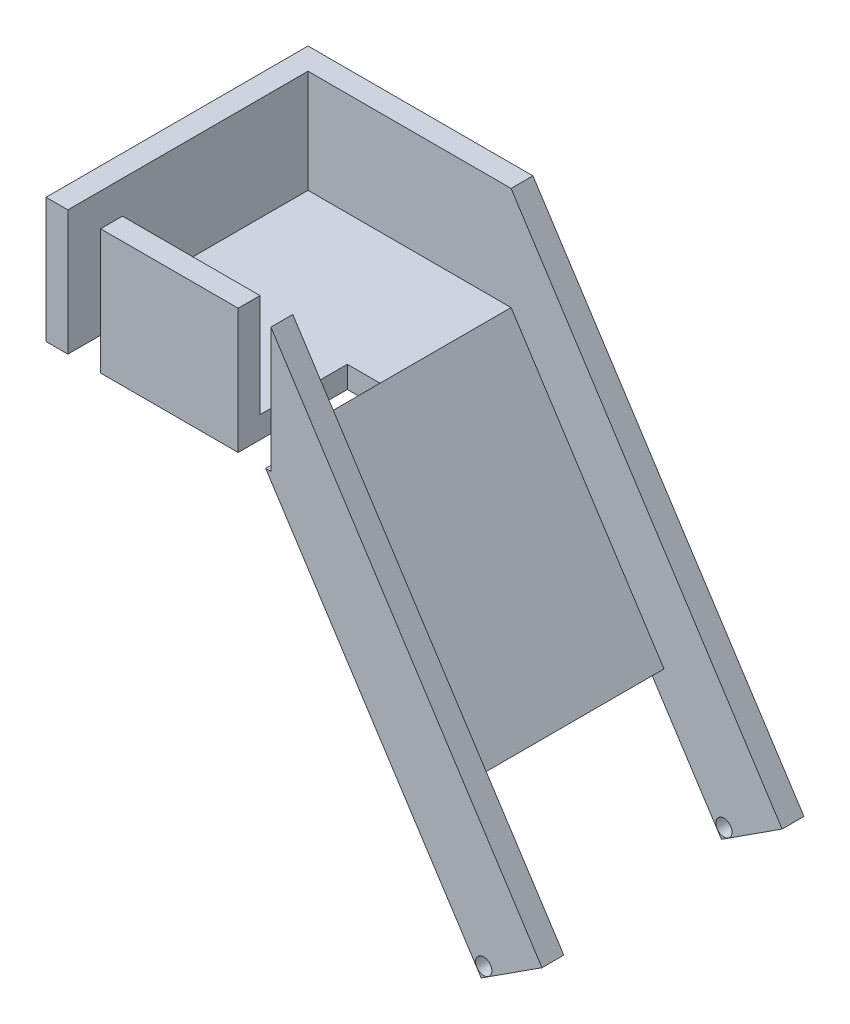
ISO-10303-21;
HEADER;
FILE_DESCRIPTION(('STEP AP214'),'2;1');
FILE_NAME('part.step','',(''),(''),'','','');
FILE_SCHEMA(('AUTOMOTIVE_DESIGN { 1 0 10303 214 1 1 1 1 }'));
ENDSEC;
DATA;
#1=APPLICATION_CONTEXT('core data for automotive mechanical design processes');
#2=APPLICATION_PROTOCOL_DEFINITION('international standard','automotive_design',2000,#1);
#3=PRODUCT_CONTEXT('',#1,'mechanical');
#4=PRODUCT('Part','Part','',(#3));
#5=PRODUCT_RELATED_PRODUCT_CATEGORY('part','',(#4));
#6=PRODUCT_DEFINITION_FORMATION('','',#4);
#7=PRODUCT_DEFINITION_CONTEXT('part definition',#1,'design');
#8=PRODUCT_DEFINITION('design','',#6,#7);
#9=PRODUCT_DEFINITION_SHAPE('','',#8);
#10=(LENGTH_UNIT() NAMED_UNIT(*) SI_UNIT(.MILLI.,.METRE.));
#11=(NAMED_UNIT(*) PLANE_ANGLE_UNIT() SI_UNIT($,.RADIAN.));
#12=(NAMED_UNIT(*) SI_UNIT($,.STERADIAN.) SOLID_ANGLE_UNIT());
#13=UNCERTAINTY_MEASURE_WITH_UNIT(LENGTH_MEASURE(1.E-05),#10,'distance_accuracy_value','');
#14=(GEOMETRIC_REPRESENTATION_CONTEXT(3) GLOBAL_UNCERTAINTY_ASSIGNED_CONTEXT((#13)) GLOBAL_UNIT_ASSIGNED_CONTEXT((#10,
#11,#12)) REPRESENTATION_CONTEXT('',''));
#15=CARTESIAN_POINT('',(0.,0.,0.));
#16=DIRECTION('',(0.,0.,1.));
#17=DIRECTION('',(1.,0.,0.));
#18=AXIS2_PLACEMENT_3D('',#15,#16,#17);
#19=CARTESIAN_POINT('',(69.0793002450423,-59.004889790228,-120.));
#20=DIRECTION('',(0.542913236200451,-0.839788793660855,0.));
#21=DIRECTION('',(0.839788793660855,0.542913236200451,0.));
#22=AXIS2_PLACEMENT_3D('',#19,#20,#21);
#23=PLANE('',#22);
#24=DIRECTION('',(0.,0.,1.));
#25=VECTOR('',#24,1.);
#26=CARTESIAN_POINT('',(62.8173272538295,-63.0531791307406,-120.));
#27=LINE('',#26,#25);
#28=CARTESIAN_POINT('',(62.8173272538295,-63.0531791307406,-10.));
#29=VERTEX_POINT('',#28);
#30=CARTESIAN_POINT('',(62.8173272538295,-63.0531791307406,0.));
#31=VERTEX_POINT('',#30);
#32=EDGE_CURVE('E238',#29,#31,#27,.T.);
#33=ORIENTED_EDGE('',*,*,#32,.F.);
#34=DIRECTION('',(0.839788793660855,0.54291323620045,0.));
#35=VECTOR('',#34,1.);
#36=CARTESIAN_POINT('',(90.6221085874557,-45.0777263387602,-10.));
#37=LINE('',#36,#35);
#38=CARTESIAN_POINT('',(90.6221085874557,-45.0777263387602,-10.));
#39=VERTEX_POINT('',#38);
#40=EDGE_CURVE('E297',#29,#39,#37,.T.);
#41=ORIENTED_EDGE('',*,*,#40,.T.);
#42=DIRECTION('',(0.,0.,1.));
#43=VECTOR('',#42,1.);
#44=CARTESIAN_POINT('',(90.6221085874557,-45.0777263387602,-10.));
#45=LINE('',#44,#43);
#46=CARTESIAN_POINT('',(90.6221085874557,-45.0777263387602,0.));
#47=VERTEX_POINT('',#46);
#48=EDGE_CURVE('E296',#39,#47,#45,.T.);
#49=ORIENTED_EDGE('',*,*,#48,.T.);
#50=DIRECTION('',(0.839788793660855,0.542913236200451,0.));
#51=VECTOR('',#50,1.);
#52=CARTESIAN_POINT('',(69.0793002450423,-59.004889790228,0.));
#53=LINE('',#52,#51);
#54=EDGE_CURVE('E248',#31,#47,#53,.T.);
#55=ORIENTED_EDGE('',*,*,#54,.F.);
#56=EDGE_LOOP('',(#33,#41,#49,#55));
#57=FACE_BOUND('',#56,.T.);
#58=ADVANCED_FACE('F33',(#57),#23,.T.);
#59=CARTESIAN_POINT('',(0.,0.,0.));
#60=DIRECTION('',(0.,0.,1.));
#61=DIRECTION('',(1.,0.,0.));
#62=AXIS2_PLACEMENT_3D('',#59,#60,#61);
#63=PLANE('',#62);
#64=DIRECTION('',(0.,-1.,0.));
#65=VECTOR('',#64,1.);
#66=CARTESIAN_POINT('',(-48.5313013968429,146.965192211674,0.));
#67=LINE('',#66,#65);
#68=CARTESIAN_POINT('',(-48.5313013968429,146.965192211674,0.));
#69=VERTEX_POINT('',#68);
#70=CARTESIAN_POINT('',(-48.5313013968429,89.7151922116735,0.));
#71=VERTEX_POINT('',#70);
#72=EDGE_CURVE('E452',#69,#71,#67,.T.);
#73=ORIENTED_EDGE('',*,*,#72,.F.);
#74=DIRECTION('',(1.,0.,0.));
#75=VECTOR('',#74,1.);
#76=CARTESIAN_POINT('',(-136.531301396843,146.965192211674,0.));
#77=LINE('',#76,#75);
#78=CARTESIAN_POINT('',(-111.531301396843,146.965192211674,0.));
#79=VERTEX_POINT('',#78);
#80=EDGE_CURVE('E321',#79,#69,#77,.T.);
#81=ORIENTED_EDGE('',*,*,#80,.F.);
#82=DIRECTION('',(0.,1.,0.));
#83=VECTOR('',#82,1.);
#84=CARTESIAN_POINT('',(-111.531301396843,146.965192211674,0.));
#85=LINE('',#84,#83);
#86=CARTESIAN_POINT('',(-111.531301396843,89.7151922116735,0.));
#87=VERTEX_POINT('',#86);
#88=EDGE_CURVE('E56',#87,#79,#85,.T.);
#89=ORIENTED_EDGE('',*,*,#88,.F.);
#90=DIRECTION('',(1.,0.,0.));
#91=VECTOR('',#90,1.);
#92=CARTESIAN_POINT('',(-136.531301396843,89.7151922116735,0.));
#93=LINE('',#92,#91);
#94=EDGE_CURVE('E272',#87,#71,#93,.T.);
#95=ORIENTED_EDGE('',*,*,#94,.T.);
#96=EDGE_LOOP('',(#73,#81,#89,#95));
#97=FACE_BOUND('',#96,.T.);
#98=ADVANCED_FACE('F368',(#97),#63,.T.);
#99=CARTESIAN_POINT('',(-33.5313013968429,146.965192211674,-10.));
#100=DIRECTION('',(0.,0.,1.));
#101=DIRECTION('',(1.,0.,0.));
#102=AXIS2_PLACEMENT_3D('',#99,#100,#101);
#103=PLANE('',#102);
#104=DIRECTION('',(-1.,0.,0.));
#105=VECTOR('',#104,1.);
#106=CARTESIAN_POINT('',(-33.5313013968429,146.965192211674,-10.));
#107=LINE('',#106,#105);
#108=CARTESIAN_POINT('',(-48.5313013968429,146.965192211674,-10.));
#109=VERTEX_POINT('',#108);
#110=CARTESIAN_POINT('',(-111.531301396843,146.965192211674,-10.));
#111=VERTEX_POINT('',#110);
#112=EDGE_CURVE('E326',#109,#111,#107,.T.);
#113=ORIENTED_EDGE('',*,*,#112,.F.);
#114=DIRECTION('',(0.,-1.,0.));
#115=VECTOR('',#114,1.);
#116=CARTESIAN_POINT('',(-48.5313013968429,146.965192211674,-10.));
#117=LINE('',#116,#115);
#118=CARTESIAN_POINT('',(-48.5313013968429,99.7151922116736,-10.));
#119=VERTEX_POINT('',#118);
#120=EDGE_CURVE('E397',#109,#119,#117,.T.);
#121=ORIENTED_EDGE('',*,*,#120,.T.);
#122=DIRECTION('',(-1.,0.,0.));
#123=VECTOR('',#122,1.);
#124=CARTESIAN_POINT('',(-33.5313013968429,99.7151922116736,-10.));
#125=LINE('',#124,#123);
#126=CARTESIAN_POINT('',(-111.531301396843,99.7151922116736,-10.));
#127=VERTEX_POINT('',#126);
#128=EDGE_CURVE('E224',#119,#127,#125,.T.);
#129=ORIENTED_EDGE('',*,*,#128,.T.);
#130=DIRECTION('',(0.,1.,0.));
#131=VECTOR('',#130,1.);
#132=CARTESIAN_POINT('',(-111.531301396843,146.965192211673,-10.));
#133=LINE('',#132,#131);
#134=EDGE_CURVE('E416',#127,#111,#133,.T.);
#135=ORIENTED_EDGE('',*,*,#134,.T.);
#136=EDGE_LOOP('',(#113,#121,#129,#135));
#137=FACE_BOUND('',#136,.T.);
#138=ADVANCED_FACE('F374',(#137),#103,.F.);
#139=DIRECTION('',(0.,-1.,0.));
#140=VECTOR('',#139,1.);
#141=CARTESIAN_POINT('',(-126.531301396843,89.7151922116735,0.));
#142=LINE('',#141,#140);
#143=CARTESIAN_POINT('',(-126.531301396843,146.965192211674,0.));
#144=VERTEX_POINT('',#143);
#145=CARTESIAN_POINT('',(-126.531301396843,89.7151922116735,0.));
#146=VERTEX_POINT('',#145);
#147=EDGE_CURVE('E395',#144,#146,#142,.T.);
#148=ORIENTED_EDGE('',*,*,#147,.F.);
#149=CARTESIAN_POINT('',(-136.531301396843,146.965192211674,0.));
#150=VERTEX_POINT('',#149);
#151=EDGE_CURVE('E322',#150,#144,#77,.T.);
#152=ORIENTED_EDGE('',*,*,#151,.F.);
#153=DIRECTION('',(0.,-1.,0.));
#154=VECTOR('',#153,1.);
#155=CARTESIAN_POINT('',(-136.531301396843,99.7151922116736,0.));
#156=LINE('',#155,#154);
#157=CARTESIAN_POINT('',(-136.531301396843,89.7151922116735,0.));
#158=VERTEX_POINT('',#157);
#159=EDGE_CURVE('E269',#150,#158,#156,.T.);
#160=ORIENTED_EDGE('',*,*,#159,.T.);
#161=EDGE_CURVE('E274',#158,#146,#93,.T.);
#162=ORIENTED_EDGE('',*,*,#161,.T.);
#163=EDGE_LOOP('',(#148,#152,#160,#162));
#164=FACE_BOUND('',#163,.T.);
#165=ADVANCED_FACE('F356',(#164),#63,.T.);
#166=CARTESIAN_POINT('',(0.,146.965192211674,0.));
#167=DIRECTION('',(0.,1.,0.));
#168=DIRECTION('',(0.,0.,1.));
#169=AXIS2_PLACEMENT_3D('',#166,#167,#168);
#170=PLANE('',#169);
#171=ORIENTED_EDGE('',*,*,#151,.T.);
#172=DIRECTION('',(0.,0.,-1.));
#173=VECTOR('',#172,1.);
#174=CARTESIAN_POINT('',(-126.531301396843,146.965192211674,-9.99999999999999));
#175=LINE('',#174,#173);
#176=CARTESIAN_POINT('',(-126.531301396843,146.965192211674,-110.));
#177=VERTEX_POINT('',#176);
#178=EDGE_CURVE('E289',#144,#177,#175,.T.);
#179=ORIENTED_EDGE('',*,*,#178,.T.);
#180=DIRECTION('',(1.,0.,0.));
#181=VECTOR('',#180,1.);
#182=CARTESIAN_POINT('',(-126.531301396843,146.965192211674,-110.));
#183=LINE('',#182,#181);
#184=CARTESIAN_POINT('',(-33.5313013968429,146.965192211674,-110.));
#185=VERTEX_POINT('',#184);
#186=EDGE_CURVE('E292',#177,#185,#183,.T.);
#187=ORIENTED_EDGE('',*,*,#186,.T.);
#188=DIRECTION('',(0.,0.,-1.));
#189=VECTOR('',#188,1.);
#190=CARTESIAN_POINT('',(-33.5313013968429,146.965192211674,-110.));
#191=LINE('',#190,#189);
#192=CARTESIAN_POINT('',(-33.5313013968429,146.965192211674,-120.));
#193=VERTEX_POINT('',#192);
#194=EDGE_CURVE('E312',#185,#193,#191,.T.);
#195=ORIENTED_EDGE('',*,*,#194,.T.);
#196=DIRECTION('',(-1.,0.,0.));
#197=VECTOR('',#196,1.);
#198=CARTESIAN_POINT('',(-33.5313013968429,146.965192211674,-120.));
#199=LINE('',#198,#197);
#200=CARTESIAN_POINT('',(-136.531301396843,146.965192211674,-120.));
#201=VERTEX_POINT('',#200);
#202=EDGE_CURVE('E315',#193,#201,#199,.T.);
#203=ORIENTED_EDGE('',*,*,#202,.T.);
#204=DIRECTION('',(0.,0.,1.));
#205=VECTOR('',#204,1.);
#206=CARTESIAN_POINT('',(-136.531301396843,146.965192211674,-120.));
#207=LINE('',#206,#205);
#208=EDGE_CURVE('E318',#201,#150,#207,.T.);
#209=ORIENTED_EDGE('',*,*,#208,.T.);
#210=EDGE_LOOP('',(#171,#179,#187,#195,#203,#209));
#211=FACE_BOUND('',#210,.T.);
#212=ADVANCED_FACE('F332',(#211),#170,.T.);
#213=CARTESIAN_POINT('',(-33.5313013968429,99.7151922116736,-120.));
#214=DIRECTION('',(0.839788793660855,0.542913236200451,0.));
#215=DIRECTION('',(-0.542913236200451,0.839788793660855,0.));
#216=AXIS2_PLACEMENT_3D('',#213,#214,#215);
#217=PLANE('',#216);
#218=DIRECTION('',(0.,0.,1.));
#219=VECTOR('',#218,1.);
#220=CARTESIAN_POINT('',(36.5045060730152,-8.6175621705767,-10.));
#221=LINE('',#220,#219);
#222=CARTESIAN_POINT('',(36.5045060730152,-8.6175621705767,-110.));
#223=VERTEX_POINT('',#222);
#224=CARTESIAN_POINT('',(36.5045060730152,-8.61756217057669,-10.));
#225=VERTEX_POINT('',#224);
#226=EDGE_CURVE('E48',#223,#225,#221,.T.);
#227=ORIENTED_EDGE('',*,*,#226,.F.);
#228=DIRECTION('',(-0.542913236200451,0.839788793660855,0.));
#229=VECTOR('',#228,1.);
#230=CARTESIAN_POINT('',(69.0793002450423,-59.004889790228,-110.));
#231=LINE('',#230,#229);
#232=CARTESIAN_POINT('',(-33.5313013968429,99.7151922116736,-110.));
#233=VERTEX_POINT('',#232);
#234=EDGE_CURVE('E201',#223,#233,#231,.T.);
#235=ORIENTED_EDGE('',*,*,#234,.T.);
#236=DIRECTION('',(0.,0.,1.));
#237=VECTOR('',#236,1.);
#238=CARTESIAN_POINT('',(-33.5313013968429,99.7151922116736,-120.));
#239=LINE('',#238,#237);
#240=CARTESIAN_POINT('',(-33.5313013968429,99.7151922116736,-50.));
#241=VERTEX_POINT('',#240);
#242=EDGE_CURVE('E232',#233,#241,#239,.T.);
#243=ORIENTED_EDGE('',*,*,#242,.T.);
#244=DIRECTION('',(0.,0.,-1.));
#245=VECTOR('',#244,1.);
#246=CARTESIAN_POINT('',(-33.5313013968429,99.7151922116736,-120.));
#247=LINE('',#246,#245);
#248=CARTESIAN_POINT('',(-33.5313013968429,99.7151922116736,-10.));
#249=VERTEX_POINT('',#248);
#250=EDGE_CURVE('E460',#249,#241,#247,.T.);
#251=ORIENTED_EDGE('',*,*,#250,.F.);
#252=DIRECTION('',(0.542913236200451,-0.839788793660855,0.));
#253=VECTOR('',#252,1.);
#254=CARTESIAN_POINT('',(69.0793002450423,-59.004889790228,-10.));
#255=LINE('',#254,#253);
#256=EDGE_CURVE('E205',#249,#225,#255,.T.);
#257=ORIENTED_EDGE('',*,*,#256,.T.);
#258=EDGE_LOOP('',(#227,#235,#243,#251,#257));
#259=FACE_BOUND('',#258,.T.);
#260=ADVANCED_FACE('F199',(#259),#217,.T.);
#261=CARTESIAN_POINT('',(-136.531301396843,99.7151922116736,-120.));
#262=DIRECTION('',(-1.,0.,0.));
#263=DIRECTION('',(0.,0.,1.));
#264=AXIS2_PLACEMENT_3D('',#261,#262,#263);
#265=PLANE('',#264);
#266=ORIENTED_EDGE('',*,*,#159,.F.);
#267=ORIENTED_EDGE('',*,*,#208,.F.);
#268=DIRECTION('',(0.,-1.,0.));
#269=VECTOR('',#268,1.);
#270=CARTESIAN_POINT('',(-136.531301396843,99.7151922116736,-120.));
#271=LINE('',#270,#269);
#272=CARTESIAN_POINT('',(-136.531301396843,89.7151922116735,-120.));
#273=VERTEX_POINT('',#272);
#274=EDGE_CURVE('E281',#201,#273,#271,.T.);
#275=ORIENTED_EDGE('',*,*,#274,.T.);
#276=DIRECTION('',(0.,0.,1.));
#277=VECTOR('',#276,1.);
#278=CARTESIAN_POINT('',(-136.531301396843,89.7151922116735,-120.));
#279=LINE('',#278,#277);
#280=EDGE_CURVE('E242',#273,#158,#279,.T.);
#281=ORIENTED_EDGE('',*,*,#280,.T.);
#282=EDGE_LOOP('',(#266,#267,#275,#281));
#283=FACE_BOUND('',#282,.T.);
#284=ADVANCED_FACE('F35',(#283),#265,.T.);
#285=CARTESIAN_POINT('',(-136.531301396843,99.7151922116736,-120.));
#286=DIRECTION('',(0.,1.,0.));
#287=DIRECTION('',(0.,0.,1.));
#288=AXIS2_PLACEMENT_3D('',#285,#286,#287);
#289=PLANE('',#288);
#290=DIRECTION('',(0.,0.,1.));
#291=VECTOR('',#290,1.);
#292=CARTESIAN_POINT('',(-48.5313013968429,99.7151922116736,-120.));
#293=LINE('',#292,#291);
#294=CARTESIAN_POINT('',(-48.5313013968429,99.7151922116736,-50.));
#295=VERTEX_POINT('',#294);
#296=EDGE_CURVE('E392',#295,#119,#293,.T.);
#297=ORIENTED_EDGE('',*,*,#296,.F.);
#298=DIRECTION('',(1.,0.,0.));
#299=VECTOR('',#298,1.);
#300=CARTESIAN_POINT('',(-136.531301396843,99.7151922116736,-50.));
#301=LINE('',#300,#299);
#302=EDGE_CURVE('E391',#295,#241,#301,.T.);
#303=ORIENTED_EDGE('',*,*,#302,.T.);
#304=ORIENTED_EDGE('',*,*,#242,.F.);
#305=DIRECTION('',(1.,0.,0.));
#306=VECTOR('',#305,1.);
#307=CARTESIAN_POINT('',(-126.531301396843,99.7151922116736,-110.));
#308=LINE('',#307,#306);
#309=CARTESIAN_POINT('',(-126.531301396843,99.7151922116736,-110.));
#310=VERTEX_POINT('',#309);
#311=EDGE_CURVE('E212',#310,#233,#308,.T.);
#312=ORIENTED_EDGE('',*,*,#311,.F.);
#313=DIRECTION('',(0.,0.,-1.));
#314=VECTOR('',#313,1.);
#315=CARTESIAN_POINT('',(-126.531301396843,99.7151922116736,-9.99999999999999));
#316=LINE('',#315,#314);
#317=CARTESIAN_POINT('',(-126.531301396843,99.7151922116736,-50.));
#318=VERTEX_POINT('',#317);
#319=EDGE_CURVE('E290',#318,#310,#316,.T.);
#320=ORIENTED_EDGE('',*,*,#319,.F.);
#321=DIRECTION('',(-1.,0.,0.));
#322=VECTOR('',#321,1.);
#323=CARTESIAN_POINT('',(-136.531301396843,99.7151922116736,-50.));
#324=LINE('',#323,#322);
#325=CARTESIAN_POINT('',(-111.531301396843,99.7151922116736,-50.));
#326=VERTEX_POINT('',#325);
#327=EDGE_CURVE('E413',#326,#318,#324,.T.);
#328=ORIENTED_EDGE('',*,*,#327,.F.);
#329=DIRECTION('',(0.,0.,-1.));
#330=VECTOR('',#329,1.);
#331=CARTESIAN_POINT('',(-111.531301396843,99.7151922116736,-120.));
#332=LINE('',#331,#330);
#333=EDGE_CURVE('E220',#127,#326,#332,.T.);
#334=ORIENTED_EDGE('',*,*,#333,.F.);
#335=ORIENTED_EDGE('',*,*,#128,.F.);
#336=EDGE_LOOP('',(#297,#303,#304,#312,#320,#328,#334,#335));
#337=FACE_BOUND('',#336,.T.);
#338=ADVANCED_FACE('F358',(#337),#289,.T.);
#339=DIRECTION('',(-0.839788793660855,-0.542913236200451,0.));
#340=VECTOR('',#339,1.);
#341=CARTESIAN_POINT('',(90.6221085874557,-45.0777263387601,-110.));
#342=LINE('',#341,#340);
#343=CARTESIAN_POINT('',(90.6221085874557,-45.0777263387601,-110.));
#344=VERTEX_POINT('',#343);
#345=CARTESIAN_POINT('',(62.8173272538295,-63.0531791307406,-110.));
#346=VERTEX_POINT('',#345);
#347=EDGE_CURVE('E217',#344,#346,#342,.T.);
#348=ORIENTED_EDGE('',*,*,#347,.T.);
#349=CARTESIAN_POINT('',(62.8173272538295,-63.0531791307406,-120.));
#350=VERTEX_POINT('',#349);
#351=EDGE_CURVE('E235',#350,#346,#27,.T.);
#352=ORIENTED_EDGE('',*,*,#351,.F.);
#353=DIRECTION('',(0.839788793660855,0.542913236200451,0.));
#354=VECTOR('',#353,1.);
#355=CARTESIAN_POINT('',(69.0793002450423,-59.004889790228,-120.));
#356=LINE('',#355,#354);
#357=CARTESIAN_POINT('',(90.6221085874557,-45.0777263387601,-120.));
#358=VERTEX_POINT('',#357);
#359=EDGE_CURVE('E255',#350,#358,#356,.T.);
#360=ORIENTED_EDGE('',*,*,#359,.T.);
#361=DIRECTION('',(0.,0.,-1.));
#362=VECTOR('',#361,1.);
#363=CARTESIAN_POINT('',(90.6221085874557,-45.0777263387601,-110.));
#364=LINE('',#363,#362);
#365=EDGE_CURVE('E302',#344,#358,#364,.T.);
#366=ORIENTED_EDGE('',*,*,#365,.F.);
#367=EDGE_LOOP('',(#348,#352,#360,#366));
#368=FACE_BOUND('',#367,.T.);
#369=ADVANCED_FACE('F363',(#368),#23,.T.);
#370=CARTESIAN_POINT('',(62.8173272538295,-63.0531791307406,-120.));
#371=DIRECTION('',(-0.839788793660854,-0.542913236200451,0.));
#372=DIRECTION('',(0.542913236200451,-0.839788793660854,0.));
#373=AXIS2_PLACEMENT_3D('',#370,#371,#372);
#374=PLANE('',#373);
#375=DIRECTION('',(-0.542913236200451,0.839788793660854,0.));
#376=VECTOR('',#375,1.);
#377=CARTESIAN_POINT('',(62.8173272538295,-63.0531791307406,-9.99999999999999));
#378=LINE('',#377,#376);
#379=CARTESIAN_POINT('',(30.2425330818024,-12.6658515110893,-10.));
#380=VERTEX_POINT('',#379);
#381=EDGE_CURVE('E11',#29,#380,#378,.T.);
#382=ORIENTED_EDGE('',*,*,#381,.F.);
#383=ORIENTED_EDGE('',*,*,#32,.T.);
#384=DIRECTION('',(0.542913236200451,-0.839788793660854,0.));
#385=VECTOR('',#384,1.);
#386=CARTESIAN_POINT('',(62.8173272538295,-63.0531791307406,0.));
#387=LINE('',#386,#385);
#388=CARTESIAN_POINT('',(-35.9455658696019,89.7151922116735,0.));
#389=VERTEX_POINT('',#388);
#390=EDGE_CURVE('E276',#389,#31,#387,.T.);
#391=ORIENTED_EDGE('',*,*,#390,.F.);
#392=DIRECTION('',(0.,0.,1.));
#393=VECTOR('',#392,1.);
#394=CARTESIAN_POINT('',(-35.9455658696019,89.7151922116736,-120.));
#395=LINE('',#394,#393);
#396=CARTESIAN_POINT('',(-35.9455658696019,89.7151922116735,-50.));
#397=VERTEX_POINT('',#396);
#398=EDGE_CURVE('E389',#397,#389,#395,.T.);
#399=ORIENTED_EDGE('',*,*,#398,.F.);
#400=DIRECTION('',(0.,0.,1.));
#401=VECTOR('',#400,1.);
#402=CARTESIAN_POINT('',(-35.9455658696019,89.7151922116735,-120.));
#403=LINE('',#402,#401);
#404=CARTESIAN_POINT('',(-35.9455658696019,89.7151922116735,-120.));
#405=VERTEX_POINT('',#404);
#406=EDGE_CURVE('E250',#405,#397,#403,.T.);
#407=ORIENTED_EDGE('',*,*,#406,.F.);
#408=DIRECTION('',(0.542913236200451,-0.839788793660854,0.));
#409=VECTOR('',#408,1.);
#410=CARTESIAN_POINT('',(62.8173272538295,-63.0531791307406,-120.));
#411=LINE('',#410,#409);
#412=EDGE_CURVE('E259',#405,#350,#411,.T.);
#413=ORIENTED_EDGE('',*,*,#412,.T.);
#414=ORIENTED_EDGE('',*,*,#351,.T.);
#415=DIRECTION('',(0.542913236200451,-0.839788793660854,0.));
#416=VECTOR('',#415,1.);
#417=CARTESIAN_POINT('',(62.8173272538295,-63.0531791307406,-110.));
#418=LINE('',#417,#416);
#419=CARTESIAN_POINT('',(30.2425330818024,-12.6658515110893,-110.));
#420=VERTEX_POINT('',#419);
#421=EDGE_CURVE('E41',#420,#346,#418,.T.);
#422=ORIENTED_EDGE('',*,*,#421,.F.);
#423=DIRECTION('',(0.,0.,-1.));
#424=VECTOR('',#423,1.);
#425=CARTESIAN_POINT('',(30.2425330818024,-12.6658515110893,-120.));
#426=LINE('',#425,#424);
#427=EDGE_CURVE('E190',#380,#420,#426,.T.);
#428=ORIENTED_EDGE('',*,*,#427,.F.);
#429=EDGE_LOOP('',(#382,#383,#391,#399,#407,#413,#414,#422,#428));
#430=FACE_BOUND('',#429,.T.);
#431=ADVANCED_FACE('F381',(#430),#374,.T.);
#432=CARTESIAN_POINT('',(-136.531301396843,89.7151922116735,-120.));
#433=DIRECTION('',(0.,-1.,0.));
#434=DIRECTION('',(0.,0.,-1.));
#435=AXIS2_PLACEMENT_3D('',#432,#433,#434);
#436=PLANE('',#435);
#437=DIRECTION('',(0.,0.,1.));
#438=VECTOR('',#437,1.);
#439=CARTESIAN_POINT('',(-48.5313013968429,89.7151922116735,-50.));
#440=LINE('',#439,#438);
#441=CARTESIAN_POINT('',(-48.5313013968429,89.7151922116735,-50.));
#442=VERTEX_POINT('',#441);
#443=EDGE_CURVE('E438',#442,#71,#440,.T.);
#444=ORIENTED_EDGE('',*,*,#443,.T.);
#445=ORIENTED_EDGE('',*,*,#94,.F.);
#446=DIRECTION('',(0.,0.,1.));
#447=VECTOR('',#446,1.);
#448=CARTESIAN_POINT('',(-111.531301396843,89.7151922116735,-50.));
#449=LINE('',#448,#447);
#450=CARTESIAN_POINT('',(-111.531301396843,89.7151922116735,-50.));
#451=VERTEX_POINT('',#450);
#452=EDGE_CURVE('E411',#451,#87,#449,.T.);
#453=ORIENTED_EDGE('',*,*,#452,.F.);
#454=DIRECTION('',(1.,0.,0.));
#455=VECTOR('',#454,1.);
#456=CARTESIAN_POINT('',(-111.531301396843,89.7151922116735,-50.));
#457=LINE('',#456,#455);
#458=CARTESIAN_POINT('',(-126.531301396843,89.7151922116735,-50.));
#459=VERTEX_POINT('',#458);
#460=EDGE_CURVE('E403',#459,#451,#457,.T.);
#461=ORIENTED_EDGE('',*,*,#460,.F.);
#462=DIRECTION('',(0.,0.,1.));
#463=VECTOR('',#462,1.);
#464=CARTESIAN_POINT('',(-126.531301396843,89.7151922116735,-50.));
#465=LINE('',#464,#463);
#466=EDGE_CURVE('E354',#459,#146,#465,.T.);
#467=ORIENTED_EDGE('',*,*,#466,.T.);
#468=ORIENTED_EDGE('',*,*,#161,.F.);
#469=ORIENTED_EDGE('',*,*,#280,.F.);
#470=DIRECTION('',(1.,0.,0.));
#471=VECTOR('',#470,1.);
#472=CARTESIAN_POINT('',(-136.531301396843,89.7151922116735,-120.));
#473=LINE('',#472,#471);
#474=EDGE_CURVE('E265',#273,#405,#473,.T.);
#475=ORIENTED_EDGE('',*,*,#474,.T.);
#476=ORIENTED_EDGE('',*,*,#406,.T.);
#477=DIRECTION('',(1.,0.,0.));
#478=VECTOR('',#477,1.);
#479=CARTESIAN_POINT('',(-48.5313013968429,89.7151922116735,-50.));
#480=LINE('',#479,#478);
#481=EDGE_CURVE('E444',#442,#397,#480,.T.);
#482=ORIENTED_EDGE('',*,*,#481,.F.);
#483=EDGE_LOOP('',(#444,#445,#453,#461,#467,#468,#469,#475,#476,#482));
#484=FACE_BOUND('',#483,.T.);
#485=ADVANCED_FACE('F350',(#484),#436,.T.);
#486=CARTESIAN_POINT('',(0.,0.,-120.));
#487=DIRECTION('',(0.,0.,1.));
#488=DIRECTION('',(1.,0.,0.));
#489=AXIS2_PLACEMENT_3D('',#486,#487,#488);
#490=PLANE('',#489);
#491=CARTESIAN_POINT('',(63.9422628253346,-57.8137760909977,-120.));
#492=DIRECTION('',(0.,0.,1.));
#493=DIRECTION('',(1.,0.,0.));
#494=AXIS2_PLACEMENT_3D('',#491,#492,#493);
#495=CIRCLE('',#494,3.73);
#496=CARTESIAN_POINT('',(67.6722628253346,-57.8137760909977,-120.));
#497=VERTEX_POINT('',#496);
#498=EDGE_CURVE('E480',#497,#497,#495,.T.);
#499=ORIENTED_EDGE('',*,*,#498,.T.);
#500=EDGE_LOOP('',(#499));
#501=FACE_BOUND('',#500,.T.);
#502=ORIENTED_EDGE('',*,*,#274,.F.);
#503=ORIENTED_EDGE('',*,*,#202,.F.);
#504=DIRECTION('',(0.542913236200451,-0.839788793660854,0.));
#505=VECTOR('',#504,1.);
#506=CARTESIAN_POINT('',(-33.5313013968429,146.965192211674,-120.));
#507=LINE('',#506,#505);
#508=EDGE_CURVE('E214',#193,#358,#507,.T.);
#509=ORIENTED_EDGE('',*,*,#508,.T.);
#510=ORIENTED_EDGE('',*,*,#359,.F.);
#511=ORIENTED_EDGE('',*,*,#412,.F.);
#512=ORIENTED_EDGE('',*,*,#474,.F.);
#513=EDGE_LOOP('',(#502,#503,#509,#510,#511,#512));
#514=FACE_BOUND('',#513,.T.);
#515=ADVANCED_FACE('F346',(#501,#514),#490,.F.);
#516=CARTESIAN_POINT('',(63.9422628253346,-57.8137760909977,0.));
#517=DIRECTION('',(0.,0.,1.));
#518=DIRECTION('',(1.,0.,0.));
#519=AXIS2_PLACEMENT_3D('',#516,#517,#518);
#520=CIRCLE('',#519,3.73);
#521=CARTESIAN_POINT('',(67.6722628253346,-57.8137760909977,0.));
#522=VERTEX_POINT('',#521);
#523=EDGE_CURVE('E206',#522,#522,#520,.T.);
#524=ORIENTED_EDGE('',*,*,#523,.F.);
#525=EDGE_LOOP('',(#524));
#526=FACE_BOUND('',#525,.T.);
#527=DIRECTION('',(1.,0.,0.));
#528=VECTOR('',#527,1.);
#529=CARTESIAN_POINT('',(-48.5313013968429,89.7151922116735,0.));
#530=LINE('',#529,#528);
#531=CARTESIAN_POINT('',(-33.5313013968429,89.7151922116735,0.));
#532=VERTEX_POINT('',#531);
#533=EDGE_CURVE('E448',#389,#532,#530,.T.);
#534=ORIENTED_EDGE('',*,*,#533,.F.);
#535=ORIENTED_EDGE('',*,*,#390,.T.);
#536=ORIENTED_EDGE('',*,*,#54,.T.);
#537=DIRECTION('',(-0.542913236200451,0.839788793660854,0.));
#538=VECTOR('',#537,1.);
#539=CARTESIAN_POINT('',(-33.5313013968429,146.965192211674,0.));
#540=LINE('',#539,#538);
#541=CARTESIAN_POINT('',(-33.5313013968429,146.965192211674,0.));
#542=VERTEX_POINT('',#541);
#543=EDGE_CURVE('E298',#47,#542,#540,.T.);
#544=ORIENTED_EDGE('',*,*,#543,.T.);
#545=DIRECTION('',(0.,1.,0.));
#546=VECTOR('',#545,1.);
#547=CARTESIAN_POINT('',(-33.5313013968429,89.7151922116735,0.));
#548=LINE('',#547,#546);
#549=EDGE_CURVE('E450',#532,#542,#548,.T.);
#550=ORIENTED_EDGE('',*,*,#549,.F.);
#551=EDGE_LOOP('',(#534,#535,#536,#544,#550));
#552=FACE_BOUND('',#551,.T.);
#553=ADVANCED_FACE('F377',(#526,#552),#63,.T.);
#554=CARTESIAN_POINT('',(-126.531301396843,146.965192211674,-110.));
#555=DIRECTION('',(0.,0.,-1.));
#556=DIRECTION('',(-1.,0.,0.));
#557=AXIS2_PLACEMENT_3D('',#554,#555,#556);
#558=PLANE('',#557);
#559=CARTESIAN_POINT('',(63.9422628253346,-57.8137760909977,-110.));
#560=DIRECTION('',(0.,0.,1.));
#561=DIRECTION('',(1.,0.,0.));
#562=AXIS2_PLACEMENT_3D('',#559,#560,#561);
#563=CIRCLE('',#562,3.73);
#564=CARTESIAN_POINT('',(67.6722628253346,-57.8137760909977,-110.));
#565=VERTEX_POINT('',#564);
#566=EDGE_CURVE('E481',#565,#565,#563,.T.);
#567=ORIENTED_EDGE('',*,*,#566,.F.);
#568=EDGE_LOOP('',(#567));
#569=FACE_BOUND('',#568,.T.);
#570=ORIENTED_EDGE('',*,*,#311,.T.);
#571=ORIENTED_EDGE('',*,*,#234,.F.);
#572=DIRECTION('',(0.839788793660855,0.542913236200451,0.));
#573=VECTOR('',#572,1.);
#574=CARTESIAN_POINT('',(28.1066181364067,-14.0466945325812,-110.));
#575=LINE('',#574,#573);
#576=EDGE_CURVE('E187',#420,#223,#575,.T.);
#577=ORIENTED_EDGE('',*,*,#576,.F.);
#578=ORIENTED_EDGE('',*,*,#421,.T.);
#579=ORIENTED_EDGE('',*,*,#347,.F.);
#580=DIRECTION('',(0.542913236200451,-0.839788793660854,0.));
#581=VECTOR('',#580,1.);
#582=CARTESIAN_POINT('',(-33.5313013968429,146.965192211674,-110.));
#583=LINE('',#582,#581);
#584=EDGE_CURVE('E213',#185,#344,#583,.T.);
#585=ORIENTED_EDGE('',*,*,#584,.F.);
#586=ORIENTED_EDGE('',*,*,#186,.F.);
#587=DIRECTION('',(0.,-1.,0.));
#588=VECTOR('',#587,1.);
#589=CARTESIAN_POINT('',(-126.531301396843,146.965192211674,-110.));
#590=LINE('',#589,#588);
#591=EDGE_CURVE('E273',#177,#310,#590,.T.);
#592=ORIENTED_EDGE('',*,*,#591,.T.);
#593=EDGE_LOOP('',(#570,#571,#577,#578,#579,#585,#586,#592));
#594=FACE_BOUND('',#593,.T.);
#595=ADVANCED_FACE('F209',(#569,#594),#558,.F.);
#596=CARTESIAN_POINT('',(63.9422628253346,-57.8137760909977,-10.));
#597=DIRECTION('',(0.,0.,1.));
#598=DIRECTION('',(1.,0.,0.));
#599=AXIS2_PLACEMENT_3D('',#596,#597,#598);
#600=CIRCLE('',#599,3.73);
#601=CARTESIAN_POINT('',(67.6722628253346,-57.8137760909977,-10.));
#602=VERTEX_POINT('',#601);
#603=EDGE_CURVE('E477',#602,#602,#600,.T.);
#604=ORIENTED_EDGE('',*,*,#603,.T.);
#605=EDGE_LOOP('',(#604));
#606=FACE_BOUND('',#605,.T.);
#607=ORIENTED_EDGE('',*,*,#256,.F.);
#608=DIRECTION('',(0.,1.,0.));
#609=VECTOR('',#608,1.);
#610=CARTESIAN_POINT('',(-33.5313013968429,146.965192211674,-10.));
#611=LINE('',#610,#609);
#612=CARTESIAN_POINT('',(-33.5313013968429,146.965192211674,-10.));
#613=VERTEX_POINT('',#612);
#614=EDGE_CURVE('E456',#249,#613,#611,.T.);
#615=ORIENTED_EDGE('',*,*,#614,.T.);
#616=DIRECTION('',(-0.542913236200451,0.839788793660854,0.));
#617=VECTOR('',#616,1.);
#618=CARTESIAN_POINT('',(-33.5313013968429,146.965192211674,-10.));
#619=LINE('',#618,#617);
#620=EDGE_CURVE('E300',#39,#613,#619,.T.);
#621=ORIENTED_EDGE('',*,*,#620,.F.);
#622=ORIENTED_EDGE('',*,*,#40,.F.);
#623=ORIENTED_EDGE('',*,*,#381,.T.);
#624=DIRECTION('',(0.839788793660855,0.542913236200451,0.));
#625=VECTOR('',#624,1.);
#626=CARTESIAN_POINT('',(28.1066181364067,-14.0466945325812,-10.));
#627=LINE('',#626,#625);
#628=EDGE_CURVE('E195',#380,#225,#627,.T.);
#629=ORIENTED_EDGE('',*,*,#628,.T.);
#630=EDGE_LOOP('',(#607,#615,#621,#622,#623,#629));
#631=FACE_BOUND('',#630,.T.);
#632=ADVANCED_FACE('F496',(#606,#631),#103,.F.);
#633=CARTESIAN_POINT('',(-126.531301396843,146.965192211674,-9.99999999999999));
#634=DIRECTION('',(-1.,0.,0.));
#635=DIRECTION('',(0.,0.,1.));
#636=AXIS2_PLACEMENT_3D('',#633,#634,#635);
#637=PLANE('',#636);
#638=DIRECTION('',(0.,-1.,0.));
#639=VECTOR('',#638,1.);
#640=CARTESIAN_POINT('',(-126.531301396843,89.7151922116735,-50.));
#641=LINE('',#640,#639);
#642=EDGE_CURVE('E401',#318,#459,#641,.T.);
#643=ORIENTED_EDGE('',*,*,#642,.F.);
#644=ORIENTED_EDGE('',*,*,#319,.T.);
#645=ORIENTED_EDGE('',*,*,#591,.F.);
#646=ORIENTED_EDGE('',*,*,#178,.F.);
#647=ORIENTED_EDGE('',*,*,#147,.T.);
#648=ORIENTED_EDGE('',*,*,#466,.F.);
#649=EDGE_LOOP('',(#643,#644,#645,#646,#647,#648));
#650=FACE_BOUND('',#649,.T.);
#651=ADVANCED_FACE('F338',(#650),#637,.F.);
#652=DIRECTION('',(0.,0.,1.));
#653=VECTOR('',#652,1.);
#654=CARTESIAN_POINT('',(-48.5313013968429,146.965192211674,-50.));
#655=LINE('',#654,#653);
#656=EDGE_CURVE('E442',#109,#69,#655,.T.);
#657=ORIENTED_EDGE('',*,*,#656,.F.);
#658=ORIENTED_EDGE('',*,*,#112,.T.);
#659=DIRECTION('',(0.,0.,-1.));
#660=VECTOR('',#659,1.);
#661=CARTESIAN_POINT('',(-111.531301396843,146.965192211674,0.));
#662=LINE('',#661,#660);
#663=EDGE_CURVE('E231',#79,#111,#662,.T.);
#664=ORIENTED_EDGE('',*,*,#663,.F.);
#665=ORIENTED_EDGE('',*,*,#80,.T.);
#666=EDGE_LOOP('',(#657,#658,#664,#665));
#667=FACE_BOUND('',#666,.T.);
#668=ADVANCED_FACE('F468',(#667),#170,.T.);
#669=CARTESIAN_POINT('',(-33.5313013968429,146.965192211674,-10.));
#670=DIRECTION('',(0.839788793660855,0.542913236200451,0.));
#671=DIRECTION('',(-0.542913236200451,0.839788793660855,0.));
#672=AXIS2_PLACEMENT_3D('',#669,#670,#671);
#673=PLANE('',#672);
#674=ORIENTED_EDGE('',*,*,#543,.F.);
#675=ORIENTED_EDGE('',*,*,#48,.F.);
#676=ORIENTED_EDGE('',*,*,#620,.T.);
#677=DIRECTION('',(0.,0.,-1.));
#678=VECTOR('',#677,1.);
#679=CARTESIAN_POINT('',(-33.5313013968429,146.965192211674,0.));
#680=LINE('',#679,#678);
#681=EDGE_CURVE('E325',#542,#613,#680,.T.);
#682=ORIENTED_EDGE('',*,*,#681,.F.);
#683=EDGE_LOOP('',(#674,#675,#676,#682));
#684=FACE_BOUND('',#683,.T.);
#685=ADVANCED_FACE('F596',(#684),#673,.T.);
#686=CARTESIAN_POINT('',(-33.5313013968429,146.965192211674,-110.));
#687=DIRECTION('',(0.839788793660855,0.542913236200451,0.));
#688=DIRECTION('',(-0.542913236200451,0.839788793660855,0.));
#689=AXIS2_PLACEMENT_3D('',#686,#687,#688);
#690=PLANE('',#689);
#691=ORIENTED_EDGE('',*,*,#508,.F.);
#692=ORIENTED_EDGE('',*,*,#194,.F.);
#693=ORIENTED_EDGE('',*,*,#584,.T.);
#694=ORIENTED_EDGE('',*,*,#365,.T.);
#695=EDGE_LOOP('',(#691,#692,#693,#694));
#696=FACE_BOUND('',#695,.T.);
#697=ADVANCED_FACE('F343',(#696),#690,.T.);
#698=CARTESIAN_POINT('',(-111.531301396843,146.965192211674,-50.));
#699=DIRECTION('',(1.,0.,0.));
#700=DIRECTION('',(0.,1.,0.));
#701=AXIS2_PLACEMENT_3D('',#698,#699,#700);
#702=PLANE('',#701);
#703=ORIENTED_EDGE('',*,*,#333,.T.);
#704=DIRECTION('',(0.,1.,0.));
#705=VECTOR('',#704,1.);
#706=CARTESIAN_POINT('',(-111.531301396843,146.965192211674,-50.));
#707=LINE('',#706,#705);
#708=EDGE_CURVE('E406',#451,#326,#707,.T.);
#709=ORIENTED_EDGE('',*,*,#708,.F.);
#710=ORIENTED_EDGE('',*,*,#452,.T.);
#711=ORIENTED_EDGE('',*,*,#88,.T.);
#712=ORIENTED_EDGE('',*,*,#663,.T.);
#713=ORIENTED_EDGE('',*,*,#134,.F.);
#714=EDGE_LOOP('',(#703,#709,#710,#711,#712,#713));
#715=FACE_BOUND('',#714,.T.);
#716=ADVANCED_FACE('F419',(#715),#702,.F.);
#717=CARTESIAN_POINT('',(0.,0.,-50.));
#718=DIRECTION('',(0.,0.,-1.));
#719=DIRECTION('',(-1.,0.,0.));
#720=AXIS2_PLACEMENT_3D('',#717,#718,#719);
#721=PLANE('',#720);
#722=ORIENTED_EDGE('',*,*,#327,.T.);
#723=ORIENTED_EDGE('',*,*,#642,.T.);
#724=ORIENTED_EDGE('',*,*,#460,.T.);
#725=ORIENTED_EDGE('',*,*,#708,.T.);
#726=EDGE_LOOP('',(#722,#723,#724,#725));
#727=FACE_BOUND('',#726,.T.);
#728=ADVANCED_FACE('F423',(#727),#721,.F.);
#729=CARTESIAN_POINT('',(-48.5313013968429,89.7151922116735,-50.));
#730=DIRECTION('',(0.,-1.,0.));
#731=DIRECTION('',(0.,0.,-1.));
#732=AXIS2_PLACEMENT_3D('',#729,#730,#731);
#733=PLANE('',#732);
#734=ORIENTED_EDGE('',*,*,#398,.T.);
#735=ORIENTED_EDGE('',*,*,#533,.T.);
#736=DIRECTION('',(0.,0.,1.));
#737=VECTOR('',#736,1.);
#738=CARTESIAN_POINT('',(-33.5313013968429,89.7151922116735,-50.));
#739=LINE('',#738,#737);
#740=CARTESIAN_POINT('',(-33.5313013968429,89.7151922116735,-50.));
#741=VERTEX_POINT('',#740);
#742=EDGE_CURVE('E439',#741,#532,#739,.T.);
#743=ORIENTED_EDGE('',*,*,#742,.F.);
#744=EDGE_CURVE('E454',#397,#741,#480,.T.);
#745=ORIENTED_EDGE('',*,*,#744,.F.);
#746=EDGE_LOOP('',(#734,#735,#743,#745));
#747=FACE_BOUND('',#746,.T.);
#748=ADVANCED_FACE('F584',(#747),#733,.F.);
#749=CARTESIAN_POINT('',(-48.5313013968429,146.965192211674,-50.));
#750=DIRECTION('',(-1.,0.,0.));
#751=DIRECTION('',(0.,-1.,0.));
#752=AXIS2_PLACEMENT_3D('',#749,#750,#751);
#753=PLANE('',#752);
#754=ORIENTED_EDGE('',*,*,#296,.T.);
#755=ORIENTED_EDGE('',*,*,#120,.F.);
#756=ORIENTED_EDGE('',*,*,#656,.T.);
#757=ORIENTED_EDGE('',*,*,#72,.T.);
#758=ORIENTED_EDGE('',*,*,#443,.F.);
#759=DIRECTION('',(0.,-1.,0.));
#760=VECTOR('',#759,1.);
#761=CARTESIAN_POINT('',(-48.5313013968429,146.965192211674,-50.));
#762=LINE('',#761,#760);
#763=EDGE_CURVE('E431',#295,#442,#762,.T.);
#764=ORIENTED_EDGE('',*,*,#763,.F.);
#765=EDGE_LOOP('',(#754,#755,#756,#757,#758,#764));
#766=FACE_BOUND('',#765,.T.);
#767=ADVANCED_FACE('F436',(#766),#753,.F.);
#768=CARTESIAN_POINT('',(-33.5313013968429,89.7151922116735,-50.));
#769=DIRECTION('',(1.,0.,0.));
#770=DIRECTION('',(0.,1.,0.));
#771=AXIS2_PLACEMENT_3D('',#768,#769,#770);
#772=PLANE('',#771);
#773=ORIENTED_EDGE('',*,*,#250,.T.);
#774=DIRECTION('',(0.,1.,0.));
#775=VECTOR('',#774,1.);
#776=CARTESIAN_POINT('',(-33.5313013968429,89.7151922116735,-50.));
#777=LINE('',#776,#775);
#778=EDGE_CURVE('E434',#741,#241,#777,.T.);
#779=ORIENTED_EDGE('',*,*,#778,.F.);
#780=ORIENTED_EDGE('',*,*,#742,.T.);
#781=ORIENTED_EDGE('',*,*,#549,.T.);
#782=ORIENTED_EDGE('',*,*,#681,.T.);
#783=ORIENTED_EDGE('',*,*,#614,.F.);
#784=EDGE_LOOP('',(#773,#779,#780,#781,#782,#783));
#785=FACE_BOUND('',#784,.T.);
#786=ADVANCED_FACE('F581',(#785),#772,.F.);
#787=CARTESIAN_POINT('',(0.,0.,-50.));
#788=DIRECTION('',(0.,0.,1.));
#789=DIRECTION('',(1.,0.,0.));
#790=AXIS2_PLACEMENT_3D('',#787,#788,#789);
#791=PLANE('',#790);
#792=ORIENTED_EDGE('',*,*,#763,.T.);
#793=ORIENTED_EDGE('',*,*,#481,.T.);
#794=ORIENTED_EDGE('',*,*,#744,.T.);
#795=ORIENTED_EDGE('',*,*,#778,.T.);
#796=ORIENTED_EDGE('',*,*,#302,.F.);
#797=EDGE_LOOP('',(#792,#793,#794,#795,#796));
#798=FACE_BOUND('',#797,.T.);
#799=ADVANCED_FACE('F429',(#798),#791,.T.);
#800=CARTESIAN_POINT('',(28.1066181364067,-14.0466945325812,-10.));
#801=DIRECTION('',(-0.542913236200451,0.839788793660855,0.));
#802=DIRECTION('',(-0.839788793660855,-0.542913236200451,0.));
#803=AXIS2_PLACEMENT_3D('',#800,#801,#802);
#804=PLANE('',#803);
#805=ORIENTED_EDGE('',*,*,#427,.T.);
#806=ORIENTED_EDGE('',*,*,#576,.T.);
#807=ORIENTED_EDGE('',*,*,#226,.T.);
#808=ORIENTED_EDGE('',*,*,#628,.F.);
#809=EDGE_LOOP('',(#805,#806,#807,#808));
#810=FACE_BOUND('',#809,.T.);
#811=ADVANCED_FACE('F188',(#810),#804,.F.);
#812=CARTESIAN_POINT('',(63.9422628253346,-57.8137760909977,0.001000000000001));
#813=DIRECTION('',(0.,0.,-1.));
#814=DIRECTION('',(-1.,0.,0.));
#815=AXIS2_PLACEMENT_3D('',#812,#813,#814);
#816=CYLINDRICAL_SURFACE('',#815,3.73);
#817=ORIENTED_EDGE('',*,*,#523,.T.);
#818=EDGE_LOOP('',(#817));
#819=FACE_BOUND('',#818,.T.);
#820=ORIENTED_EDGE('',*,*,#603,.F.);
#821=EDGE_LOOP('',(#820));
#822=FACE_BOUND('',#821,.T.);
#823=ADVANCED_FACE('F491',(#819,#822),#816,.F.);
#824=CARTESIAN_POINT('',(63.9422628253346,-57.8137760909977,-120.));
#825=DIRECTION('',(0.,0.,1.));
#826=DIRECTION('',(1.,0.,0.));
#827=AXIS2_PLACEMENT_3D('',#824,#825,#826);
#828=CYLINDRICAL_SURFACE('',#827,3.73);
#829=ORIENTED_EDGE('',*,*,#498,.F.);
#830=EDGE_LOOP('',(#829));
#831=FACE_BOUND('',#830,.T.);
#832=ORIENTED_EDGE('',*,*,#566,.T.);
#833=EDGE_LOOP('',(#832));
#834=FACE_BOUND('',#833,.T.);
#835=ADVANCED_FACE('F488',(#831,#834),#828,.F.);
#836=CLOSED_SHELL('',(#58,#98,#138,#165,#212,#260,#284,#338,#369,#431,#485,#515,#553,#595,#632,
#651,#668,#685,#697,#716,#728,#748,#767,#786,#799,#811,#823,#835));
#837=MANIFOLD_SOLID_BREP('B2',#836);
#838=ADVANCED_BREP_SHAPE_REPRESENTATION('',(#18,#837),#14);
#839=SHAPE_DEFINITION_REPRESENTATION(#9,#838);
ENDSEC;
END-ISO-10303-21;
